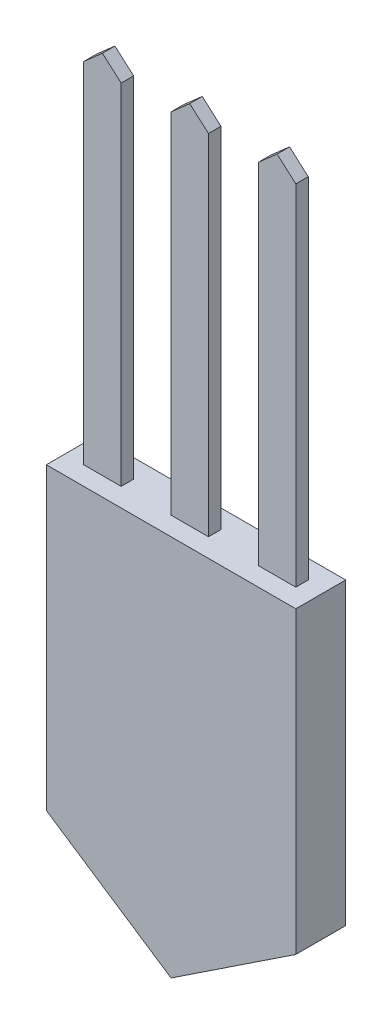
ISO-10303-21;
HEADER;
FILE_DESCRIPTION(('STEP AP214'),'2;1');
FILE_NAME('part.step','',(''),(''),'','','');
FILE_SCHEMA(('AUTOMOTIVE_DESIGN { 1 0 10303 214 1 1 1 1 }'));
ENDSEC;
DATA;
#1=APPLICATION_CONTEXT('core data for automotive mechanical design processes');
#2=APPLICATION_PROTOCOL_DEFINITION('international standard','automotive_design',2000,#1);
#3=PRODUCT_CONTEXT('',#1,'mechanical');
#4=PRODUCT('Part','Part','',(#3));
#5=PRODUCT_RELATED_PRODUCT_CATEGORY('part','',(#4));
#6=PRODUCT_DEFINITION_FORMATION('','',#4);
#7=PRODUCT_DEFINITION_CONTEXT('part definition',#1,'design');
#8=PRODUCT_DEFINITION('design','',#6,#7);
#9=PRODUCT_DEFINITION_SHAPE('','',#8);
#10=(LENGTH_UNIT() NAMED_UNIT(*) SI_UNIT(.MILLI.,.METRE.));
#11=(NAMED_UNIT(*) PLANE_ANGLE_UNIT() SI_UNIT($,.RADIAN.));
#12=(NAMED_UNIT(*) SI_UNIT($,.STERADIAN.) SOLID_ANGLE_UNIT());
#13=UNCERTAINTY_MEASURE_WITH_UNIT(LENGTH_MEASURE(1.E-05),#10,'distance_accuracy_value','');
#14=(GEOMETRIC_REPRESENTATION_CONTEXT(3) GLOBAL_UNCERTAINTY_ASSIGNED_CONTEXT((#13)) GLOBAL_UNIT_ASSIGNED_CONTEXT((#10,
#11,#12)) REPRESENTATION_CONTEXT('',''));
#15=CARTESIAN_POINT('',(0.,0.,0.));
#16=DIRECTION('',(0.,0.,1.));
#17=DIRECTION('',(1.,0.,0.));
#18=AXIS2_PLACEMENT_3D('',#15,#16,#17);
#19=CARTESIAN_POINT('',(0.,76.2,0.));
#20=DIRECTION('',(0.,-1.,0.));
#21=DIRECTION('',(0.,0.,-1.));
#22=AXIS2_PLACEMENT_3D('',#19,#20,#21);
#23=PLANE('',#22);
#24=DIRECTION('',(0.,0.,-1.));
#25=VECTOR('',#24,1.);
#26=CARTESIAN_POINT('',(-17.4625,76.2,1.5875));
#27=LINE('',#26,#25);
#28=CARTESIAN_POINT('',(-17.4625,76.2,1.5875));
#29=VERTEX_POINT('',#28);
#30=CARTESIAN_POINT('',(-17.4625,76.2,-1.5875));
#31=VERTEX_POINT('',#30);
#32=EDGE_CURVE('E265',#29,#31,#27,.T.);
#33=ORIENTED_EDGE('',*,*,#32,.F.);
#34=DIRECTION('',(1.,0.,0.));
#35=VECTOR('',#34,1.);
#36=CARTESIAN_POINT('',(-26.9875,76.2,1.5875));
#37=LINE('',#36,#35);
#38=CARTESIAN_POINT('',(-26.9875,76.2,1.5875));
#39=VERTEX_POINT('',#38);
#40=EDGE_CURVE('E255',#39,#29,#37,.T.);
#41=ORIENTED_EDGE('',*,*,#40,.F.);
#42=DIRECTION('',(0.,0.,1.));
#43=VECTOR('',#42,1.);
#44=CARTESIAN_POINT('',(-26.9875,76.2,1.5875));
#45=LINE('',#44,#43);
#46=CARTESIAN_POINT('',(-26.9875,76.2,-1.5875));
#47=VERTEX_POINT('',#46);
#48=EDGE_CURVE('E259',#47,#39,#45,.T.);
#49=ORIENTED_EDGE('',*,*,#48,.F.);
#50=DIRECTION('',(-1.,0.,0.));
#51=VECTOR('',#50,1.);
#52=CARTESIAN_POINT('',(-26.9875,76.2,-1.5875));
#53=LINE('',#52,#51);
#54=EDGE_CURVE('E262',#31,#47,#53,.T.);
#55=ORIENTED_EDGE('',*,*,#54,.F.);
#56=EDGE_LOOP('',(#33,#41,#49,#55));
#57=FACE_BOUND('',#56,.T.);
#58=DIRECTION('',(0.,0.,-1.));
#59=VECTOR('',#58,1.);
#60=CARTESIAN_POINT('',(31.75,76.2,6.35));
#61=LINE('',#60,#59);
#62=CARTESIAN_POINT('',(31.75,76.2,6.35));
#63=VERTEX_POINT('',#62);
#64=CARTESIAN_POINT('',(31.75,76.2,-6.35));
#65=VERTEX_POINT('',#64);
#66=EDGE_CURVE('E192',#63,#65,#61,.T.);
#67=ORIENTED_EDGE('',*,*,#66,.T.);
#68=DIRECTION('',(-1.,0.,0.));
#69=VECTOR('',#68,1.);
#70=CARTESIAN_POINT('',(-31.75,76.2,-6.35));
#71=LINE('',#70,#69);
#72=CARTESIAN_POINT('',(-31.75,76.2,-6.35));
#73=VERTEX_POINT('',#72);
#74=EDGE_CURVE('E209',#65,#73,#71,.T.);
#75=ORIENTED_EDGE('',*,*,#74,.T.);
#76=DIRECTION('',(0.,0.,1.));
#77=VECTOR('',#76,1.);
#78=CARTESIAN_POINT('',(-31.75,76.2,6.35));
#79=LINE('',#78,#77);
#80=CARTESIAN_POINT('',(-31.75,76.2,6.35));
#81=VERTEX_POINT('',#80);
#82=EDGE_CURVE('E207',#73,#81,#79,.T.);
#83=ORIENTED_EDGE('',*,*,#82,.T.);
#84=DIRECTION('',(1.,0.,0.));
#85=VECTOR('',#84,1.);
#86=CARTESIAN_POINT('',(-31.75,76.2,6.35));
#87=LINE('',#86,#85);
#88=EDGE_CURVE('E197',#81,#63,#87,.T.);
#89=ORIENTED_EDGE('',*,*,#88,.T.);
#90=EDGE_LOOP('',(#67,#75,#83,#89));
#91=FACE_BOUND('',#90,.T.);
#92=DIRECTION('',(0.,0.,-1.));
#93=VECTOR('',#92,1.);
#94=CARTESIAN_POINT('',(4.7625,76.2,1.5875));
#95=LINE('',#94,#93);
#96=CARTESIAN_POINT('',(4.7625,76.2,1.5875));
#97=VERTEX_POINT('',#96);
#98=CARTESIAN_POINT('',(4.7625,76.2,-1.5875));
#99=VERTEX_POINT('',#98);
#100=EDGE_CURVE('E235',#97,#99,#95,.T.);
#101=ORIENTED_EDGE('',*,*,#100,.F.);
#102=DIRECTION('',(1.,0.,0.));
#103=VECTOR('',#102,1.);
#104=CARTESIAN_POINT('',(-4.7625,76.2,1.5875));
#105=LINE('',#104,#103);
#106=CARTESIAN_POINT('',(-4.7625,76.2,1.5875));
#107=VERTEX_POINT('',#106);
#108=EDGE_CURVE('E225',#107,#97,#105,.T.);
#109=ORIENTED_EDGE('',*,*,#108,.F.);
#110=DIRECTION('',(0.,0.,1.));
#111=VECTOR('',#110,1.);
#112=CARTESIAN_POINT('',(-4.7625,76.2,1.5875));
#113=LINE('',#112,#111);
#114=CARTESIAN_POINT('',(-4.7625,76.2,-1.5875));
#115=VERTEX_POINT('',#114);
#116=EDGE_CURVE('E229',#115,#107,#113,.T.);
#117=ORIENTED_EDGE('',*,*,#116,.F.);
#118=DIRECTION('',(-1.,0.,0.));
#119=VECTOR('',#118,1.);
#120=CARTESIAN_POINT('',(-4.7625,76.2,-1.5875));
#121=LINE('',#120,#119);
#122=EDGE_CURVE('E232',#99,#115,#121,.T.);
#123=ORIENTED_EDGE('',*,*,#122,.F.);
#124=EDGE_LOOP('',(#101,#109,#117,#123));
#125=FACE_BOUND('',#124,.T.);
#126=DIRECTION('',(0.,0.,1.));
#127=VECTOR('',#126,1.);
#128=CARTESIAN_POINT('',(17.4625,76.2,1.5875));
#129=LINE('',#128,#127);
#130=CARTESIAN_POINT('',(17.4625,76.2,-1.5875));
#131=VERTEX_POINT('',#130);
#132=CARTESIAN_POINT('',(17.4625,76.2,1.5875));
#133=VERTEX_POINT('',#132);
#134=EDGE_CURVE('E290',#131,#133,#129,.T.);
#135=ORIENTED_EDGE('',*,*,#134,.F.);
#136=DIRECTION('',(-1.,0.,0.));
#137=VECTOR('',#136,1.);
#138=CARTESIAN_POINT('',(26.9875,76.2,-1.5875));
#139=LINE('',#138,#137);
#140=CARTESIAN_POINT('',(26.9875,76.2,-1.5875));
#141=VERTEX_POINT('',#140);
#142=EDGE_CURVE('E284',#141,#131,#139,.T.);
#143=ORIENTED_EDGE('',*,*,#142,.F.);
#144=DIRECTION('',(0.,0.,-1.));
#145=VECTOR('',#144,1.);
#146=CARTESIAN_POINT('',(26.9875,76.2,1.5875));
#147=LINE('',#146,#145);
#148=CARTESIAN_POINT('',(26.9875,76.2,1.5875));
#149=VERTEX_POINT('',#148);
#150=EDGE_CURVE('E56',#149,#141,#147,.T.);
#151=ORIENTED_EDGE('',*,*,#150,.F.);
#152=DIRECTION('',(1.,0.,0.));
#153=VECTOR('',#152,1.);
#154=CARTESIAN_POINT('',(26.9875,76.2,1.5875));
#155=LINE('',#154,#153);
#156=EDGE_CURVE('E51',#133,#149,#155,.T.);
#157=ORIENTED_EDGE('',*,*,#156,.F.);
#158=EDGE_LOOP('',(#135,#143,#151,#157));
#159=FACE_BOUND('',#158,.T.);
#160=ADVANCED_FACE('F36',(#57,#91,#125,#159),#23,.F.);
#161=CARTESIAN_POINT('',(31.75,76.2,6.35));
#162=DIRECTION('',(-1.,0.,0.));
#163=DIRECTION('',(0.,0.,1.));
#164=AXIS2_PLACEMENT_3D('',#161,#162,#163);
#165=PLANE('',#164);
#166=DIRECTION('',(0.,0.,-1.));
#167=VECTOR('',#166,1.);
#168=CARTESIAN_POINT('',(31.75,0.,6.35));
#169=LINE('',#168,#167);
#170=CARTESIAN_POINT('',(31.75,0.,6.35));
#171=VERTEX_POINT('',#170);
#172=CARTESIAN_POINT('',(31.75,0.,-6.34999999999999));
#173=VERTEX_POINT('',#172);
#174=EDGE_CURVE('E193',#171,#173,#169,.T.);
#175=ORIENTED_EDGE('',*,*,#174,.T.);
#176=DIRECTION('',(0.,-1.,0.));
#177=VECTOR('',#176,1.);
#178=CARTESIAN_POINT('',(31.75,76.2,-6.35));
#179=LINE('',#178,#177);
#180=EDGE_CURVE('E11',#65,#173,#179,.T.);
#181=ORIENTED_EDGE('',*,*,#180,.F.);
#182=ORIENTED_EDGE('',*,*,#66,.F.);
#183=DIRECTION('',(0.,-1.,0.));
#184=VECTOR('',#183,1.);
#185=CARTESIAN_POINT('',(31.75,76.2,6.35));
#186=LINE('',#185,#184);
#187=EDGE_CURVE('E198',#63,#171,#186,.T.);
#188=ORIENTED_EDGE('',*,*,#187,.T.);
#189=EDGE_LOOP('',(#175,#181,#182,#188));
#190=FACE_BOUND('',#189,.T.);
#191=ADVANCED_FACE('F38',(#190),#165,.F.);
#192=CARTESIAN_POINT('',(-31.75,76.2,-6.35));
#193=DIRECTION('',(0.,0.,1.));
#194=DIRECTION('',(1.,0.,0.));
#195=AXIS2_PLACEMENT_3D('',#192,#193,#194);
#196=PLANE('',#195);
#197=ORIENTED_EDGE('',*,*,#180,.T.);
#198=DIRECTION('',(-0.833333333333333,-0.552770798392567,0.));
#199=VECTOR('',#198,1.);
#200=CARTESIAN_POINT('',(31.75,0.,-6.34999999999999));
#201=LINE('',#200,#199);
#202=CARTESIAN_POINT('',(0.,-21.0605674187568,-6.34999999999999));
#203=VERTEX_POINT('',#202);
#204=EDGE_CURVE('E338',#173,#203,#201,.T.);
#205=ORIENTED_EDGE('',*,*,#204,.T.);
#206=DIRECTION('',(-0.833333333333333,0.552770798392567,0.));
#207=VECTOR('',#206,1.);
#208=CARTESIAN_POINT('',(0.,-21.0605674187568,-6.34999999999999));
#209=LINE('',#208,#207);
#210=CARTESIAN_POINT('',(-31.75,0.,-6.35));
#211=VERTEX_POINT('',#210);
#212=EDGE_CURVE('E333',#203,#211,#209,.T.);
#213=ORIENTED_EDGE('',*,*,#212,.T.);
#214=DIRECTION('',(0.,-1.,0.));
#215=VECTOR('',#214,1.);
#216=CARTESIAN_POINT('',(-31.75,76.2,-6.35));
#217=LINE('',#216,#215);
#218=EDGE_CURVE('E44',#73,#211,#217,.T.);
#219=ORIENTED_EDGE('',*,*,#218,.F.);
#220=ORIENTED_EDGE('',*,*,#74,.F.);
#221=EDGE_LOOP('',(#197,#205,#213,#219,#220));
#222=FACE_BOUND('',#221,.T.);
#223=ADVANCED_FACE('F342',(#222),#196,.F.);
#224=CARTESIAN_POINT('',(-31.75,76.2,6.35));
#225=DIRECTION('',(1.,0.,0.));
#226=DIRECTION('',(0.,0.,-1.));
#227=AXIS2_PLACEMENT_3D('',#224,#225,#226);
#228=PLANE('',#227);
#229=DIRECTION('',(0.,0.,1.));
#230=VECTOR('',#229,1.);
#231=CARTESIAN_POINT('',(-31.75,0.,6.35));
#232=LINE('',#231,#230);
#233=CARTESIAN_POINT('',(-31.75,0.,6.35));
#234=VERTEX_POINT('',#233);
#235=EDGE_CURVE('E174',#211,#234,#232,.T.);
#236=ORIENTED_EDGE('',*,*,#235,.T.);
#237=DIRECTION('',(0.,-1.,0.));
#238=VECTOR('',#237,1.);
#239=CARTESIAN_POINT('',(-31.75,76.2,6.35));
#240=LINE('',#239,#238);
#241=EDGE_CURVE('E189',#81,#234,#240,.T.);
#242=ORIENTED_EDGE('',*,*,#241,.F.);
#243=ORIENTED_EDGE('',*,*,#82,.F.);
#244=ORIENTED_EDGE('',*,*,#218,.T.);
#245=EDGE_LOOP('',(#236,#242,#243,#244));
#246=FACE_BOUND('',#245,.T.);
#247=ADVANCED_FACE('F187',(#246),#228,.F.);
#248=CARTESIAN_POINT('',(-31.75,76.2,6.35));
#249=DIRECTION('',(0.,0.,-1.));
#250=DIRECTION('',(-1.,0.,0.));
#251=AXIS2_PLACEMENT_3D('',#248,#249,#250);
#252=PLANE('',#251);
#253=ORIENTED_EDGE('',*,*,#241,.T.);
#254=DIRECTION('',(0.833333333333333,-0.552770798392567,0.));
#255=VECTOR('',#254,1.);
#256=CARTESIAN_POINT('',(0.,-21.0605674187568,6.35));
#257=LINE('',#256,#255);
#258=CARTESIAN_POINT('',(0.,-21.0605674187568,6.35));
#259=VERTEX_POINT('',#258);
#260=EDGE_CURVE('E170',#234,#259,#257,.T.);
#261=ORIENTED_EDGE('',*,*,#260,.T.);
#262=DIRECTION('',(0.833333333333333,0.552770798392567,0.));
#263=VECTOR('',#262,1.);
#264=CARTESIAN_POINT('',(31.75,0.,6.35));
#265=LINE('',#264,#263);
#266=EDGE_CURVE('E182',#259,#171,#265,.T.);
#267=ORIENTED_EDGE('',*,*,#266,.T.);
#268=ORIENTED_EDGE('',*,*,#187,.F.);
#269=ORIENTED_EDGE('',*,*,#88,.F.);
#270=EDGE_LOOP('',(#253,#261,#267,#268,#269));
#271=FACE_BOUND('',#270,.T.);
#272=ADVANCED_FACE('F195',(#271),#252,.F.);
#273=CARTESIAN_POINT('',(4.7625,165.1,1.5875));
#274=DIRECTION('',(-1.,0.,0.));
#275=DIRECTION('',(0.,0.,1.));
#276=AXIS2_PLACEMENT_3D('',#273,#274,#275);
#277=PLANE('',#276);
#278=ORIENTED_EDGE('',*,*,#100,.T.);
#279=DIRECTION('',(0.,-1.,0.));
#280=VECTOR('',#279,1.);
#281=CARTESIAN_POINT('',(4.7625,165.1,-1.5875));
#282=LINE('',#281,#280);
#283=CARTESIAN_POINT('',(4.7625,165.1,-1.5875));
#284=VERTEX_POINT('',#283);
#285=EDGE_CURVE('E205',#284,#99,#282,.T.);
#286=ORIENTED_EDGE('',*,*,#285,.F.);
#287=DIRECTION('',(0.,0.,-1.));
#288=VECTOR('',#287,1.);
#289=CARTESIAN_POINT('',(4.7625,165.1,1.5875));
#290=LINE('',#289,#288);
#291=CARTESIAN_POINT('',(4.7625,165.1,1.5875));
#292=VERTEX_POINT('',#291);
#293=EDGE_CURVE('E228',#292,#284,#290,.T.);
#294=ORIENTED_EDGE('',*,*,#293,.F.);
#295=DIRECTION('',(0.,-1.,0.));
#296=VECTOR('',#295,1.);
#297=CARTESIAN_POINT('',(4.7625,165.1,1.5875));
#298=LINE('',#297,#296);
#299=EDGE_CURVE('E221',#292,#97,#298,.T.);
#300=ORIENTED_EDGE('',*,*,#299,.T.);
#301=EDGE_LOOP('',(#278,#286,#294,#300));
#302=FACE_BOUND('',#301,.T.);
#303=ADVANCED_FACE('F409',(#302),#277,.F.);
#304=CARTESIAN_POINT('',(-4.7625,165.1,-1.5875));
#305=DIRECTION('',(0.,0.,1.));
#306=DIRECTION('',(1.,0.,0.));
#307=AXIS2_PLACEMENT_3D('',#304,#305,#306);
#308=PLANE('',#307);
#309=ORIENTED_EDGE('',*,*,#122,.T.);
#310=DIRECTION('',(0.,-1.,0.));
#311=VECTOR('',#310,1.);
#312=CARTESIAN_POINT('',(-4.7625,165.1,-1.5875));
#313=LINE('',#312,#311);
#314=CARTESIAN_POINT('',(-4.7625,165.1,-1.5875));
#315=VERTEX_POINT('',#314);
#316=EDGE_CURVE('E215',#315,#115,#313,.T.);
#317=ORIENTED_EDGE('',*,*,#316,.F.);
#318=DIRECTION('',(0.75,0.661437827766148,0.));
#319=VECTOR('',#318,1.);
#320=CARTESIAN_POINT('',(-4.7625,165.1,-1.5875));
#321=LINE('',#320,#319);
#322=CARTESIAN_POINT('',(0.,169.300130206315,-1.5875));
#323=VERTEX_POINT('',#322);
#324=EDGE_CURVE('E314',#315,#323,#321,.T.);
#325=ORIENTED_EDGE('',*,*,#324,.T.);
#326=DIRECTION('',(0.75,-0.661437827766148,0.));
#327=VECTOR('',#326,1.);
#328=CARTESIAN_POINT('',(0.,169.300130206315,-1.5875));
#329=LINE('',#328,#327);
#330=EDGE_CURVE('E317',#323,#284,#329,.T.);
#331=ORIENTED_EDGE('',*,*,#330,.T.);
#332=ORIENTED_EDGE('',*,*,#285,.T.);
#333=EDGE_LOOP('',(#309,#317,#325,#331,#332));
#334=FACE_BOUND('',#333,.T.);
#335=ADVANCED_FACE('F405',(#334),#308,.F.);
#336=CARTESIAN_POINT('',(-4.7625,165.1,1.5875));
#337=DIRECTION('',(1.,0.,0.));
#338=DIRECTION('',(0.,0.,-1.));
#339=AXIS2_PLACEMENT_3D('',#336,#337,#338);
#340=PLANE('',#339);
#341=ORIENTED_EDGE('',*,*,#116,.T.);
#342=DIRECTION('',(0.,-1.,0.));
#343=VECTOR('',#342,1.);
#344=CARTESIAN_POINT('',(-4.7625,165.1,1.5875));
#345=LINE('',#344,#343);
#346=CARTESIAN_POINT('',(-4.7625,165.1,1.5875));
#347=VERTEX_POINT('',#346);
#348=EDGE_CURVE('E218',#347,#107,#345,.T.);
#349=ORIENTED_EDGE('',*,*,#348,.F.);
#350=DIRECTION('',(0.,0.,1.));
#351=VECTOR('',#350,1.);
#352=CARTESIAN_POINT('',(-4.7625,165.1,1.5875));
#353=LINE('',#352,#351);
#354=EDGE_CURVE('E224',#315,#347,#353,.T.);
#355=ORIENTED_EDGE('',*,*,#354,.F.);
#356=ORIENTED_EDGE('',*,*,#316,.T.);
#357=EDGE_LOOP('',(#341,#349,#355,#356));
#358=FACE_BOUND('',#357,.T.);
#359=ADVANCED_FACE('F401',(#358),#340,.F.);
#360=CARTESIAN_POINT('',(-4.7625,165.1,1.5875));
#361=DIRECTION('',(0.,0.,-1.));
#362=DIRECTION('',(-1.,0.,0.));
#363=AXIS2_PLACEMENT_3D('',#360,#361,#362);
#364=PLANE('',#363);
#365=ORIENTED_EDGE('',*,*,#108,.T.);
#366=ORIENTED_EDGE('',*,*,#299,.F.);
#367=DIRECTION('',(-0.749999999999999,0.661437827766148,0.));
#368=VECTOR('',#367,1.);
#369=CARTESIAN_POINT('',(0.,169.300130206315,1.5875));
#370=LINE('',#369,#368);
#371=CARTESIAN_POINT('',(0.,169.300130206315,1.5875));
#372=VERTEX_POINT('',#371);
#373=EDGE_CURVE('E307',#292,#372,#370,.T.);
#374=ORIENTED_EDGE('',*,*,#373,.T.);
#375=DIRECTION('',(-0.749999999999999,-0.661437827766148,0.));
#376=VECTOR('',#375,1.);
#377=CARTESIAN_POINT('',(-4.7625,165.1,1.5875));
#378=LINE('',#377,#376);
#379=EDGE_CURVE('E313',#372,#347,#378,.T.);
#380=ORIENTED_EDGE('',*,*,#379,.T.);
#381=ORIENTED_EDGE('',*,*,#348,.T.);
#382=EDGE_LOOP('',(#365,#366,#374,#380,#381));
#383=FACE_BOUND('',#382,.T.);
#384=ADVANCED_FACE('F397',(#383),#364,.F.);
#385=CARTESIAN_POINT('',(-17.4625,165.1,1.5875));
#386=DIRECTION('',(-1.,0.,0.));
#387=DIRECTION('',(0.,0.,1.));
#388=AXIS2_PLACEMENT_3D('',#385,#386,#387);
#389=PLANE('',#388);
#390=ORIENTED_EDGE('',*,*,#32,.T.);
#391=DIRECTION('',(0.,-1.,0.));
#392=VECTOR('',#391,1.);
#393=CARTESIAN_POINT('',(-17.4625,165.1,-1.5875));
#394=LINE('',#393,#392);
#395=CARTESIAN_POINT('',(-17.4625,165.1,-1.5875));
#396=VERTEX_POINT('',#395);
#397=EDGE_CURVE('E238',#396,#31,#394,.T.);
#398=ORIENTED_EDGE('',*,*,#397,.F.);
#399=DIRECTION('',(0.,0.,-1.));
#400=VECTOR('',#399,1.);
#401=CARTESIAN_POINT('',(-17.4625,165.1,1.5875));
#402=LINE('',#401,#400);
#403=CARTESIAN_POINT('',(-17.4625,165.1,1.5875));
#404=VERTEX_POINT('',#403);
#405=EDGE_CURVE('E258',#404,#396,#402,.T.);
#406=ORIENTED_EDGE('',*,*,#405,.F.);
#407=DIRECTION('',(0.,-1.,0.));
#408=VECTOR('',#407,1.);
#409=CARTESIAN_POINT('',(-17.4625,165.1,1.5875));
#410=LINE('',#409,#408);
#411=EDGE_CURVE('E251',#404,#29,#410,.T.);
#412=ORIENTED_EDGE('',*,*,#411,.T.);
#413=EDGE_LOOP('',(#390,#398,#406,#412));
#414=FACE_BOUND('',#413,.T.);
#415=ADVANCED_FACE('F393',(#414),#389,.F.);
#416=CARTESIAN_POINT('',(-26.9875,165.1,-1.5875));
#417=DIRECTION('',(0.,0.,1.));
#418=DIRECTION('',(1.,0.,0.));
#419=AXIS2_PLACEMENT_3D('',#416,#417,#418);
#420=PLANE('',#419);
#421=ORIENTED_EDGE('',*,*,#54,.T.);
#422=DIRECTION('',(0.,-1.,0.));
#423=VECTOR('',#422,1.);
#424=CARTESIAN_POINT('',(-26.9875,165.1,-1.5875));
#425=LINE('',#424,#423);
#426=CARTESIAN_POINT('',(-26.9875,165.1,-1.5875));
#427=VERTEX_POINT('',#426);
#428=EDGE_CURVE('E245',#427,#47,#425,.T.);
#429=ORIENTED_EDGE('',*,*,#428,.F.);
#430=DIRECTION('',(0.749999999999999,0.661437827766148,0.));
#431=VECTOR('',#430,1.);
#432=CARTESIAN_POINT('',(-26.9875,165.1,-1.5875));
#433=LINE('',#432,#431);
#434=CARTESIAN_POINT('',(-22.225,169.300130206315,-1.5875));
#435=VERTEX_POINT('',#434);
#436=EDGE_CURVE('E327',#427,#435,#433,.T.);
#437=ORIENTED_EDGE('',*,*,#436,.T.);
#438=DIRECTION('',(0.749999999999999,-0.661437827766148,0.));
#439=VECTOR('',#438,1.);
#440=CARTESIAN_POINT('',(-22.225,169.300130206315,-1.5875));
#441=LINE('',#440,#439);
#442=EDGE_CURVE('E330',#435,#396,#441,.T.);
#443=ORIENTED_EDGE('',*,*,#442,.T.);
#444=ORIENTED_EDGE('',*,*,#397,.T.);
#445=EDGE_LOOP('',(#421,#429,#437,#443,#444));
#446=FACE_BOUND('',#445,.T.);
#447=ADVANCED_FACE('F389',(#446),#420,.F.);
#448=CARTESIAN_POINT('',(-26.9875,165.1,1.5875));
#449=DIRECTION('',(1.,0.,0.));
#450=DIRECTION('',(0.,0.,-1.));
#451=AXIS2_PLACEMENT_3D('',#448,#449,#450);
#452=PLANE('',#451);
#453=ORIENTED_EDGE('',*,*,#48,.T.);
#454=DIRECTION('',(0.,-1.,0.));
#455=VECTOR('',#454,1.);
#456=CARTESIAN_POINT('',(-26.9875,165.1,1.5875));
#457=LINE('',#456,#455);
#458=CARTESIAN_POINT('',(-26.9875,165.1,1.5875));
#459=VERTEX_POINT('',#458);
#460=EDGE_CURVE('E248',#459,#39,#457,.T.);
#461=ORIENTED_EDGE('',*,*,#460,.F.);
#462=DIRECTION('',(0.,0.,1.));
#463=VECTOR('',#462,1.);
#464=CARTESIAN_POINT('',(-26.9875,165.1,1.5875));
#465=LINE('',#464,#463);
#466=EDGE_CURVE('E254',#427,#459,#465,.T.);
#467=ORIENTED_EDGE('',*,*,#466,.F.);
#468=ORIENTED_EDGE('',*,*,#428,.T.);
#469=EDGE_LOOP('',(#453,#461,#467,#468));
#470=FACE_BOUND('',#469,.T.);
#471=ADVANCED_FACE('F385',(#470),#452,.F.);
#472=CARTESIAN_POINT('',(-26.9875,165.1,1.5875));
#473=DIRECTION('',(0.,0.,-1.));
#474=DIRECTION('',(-1.,0.,0.));
#475=AXIS2_PLACEMENT_3D('',#472,#473,#474);
#476=PLANE('',#475);
#477=ORIENTED_EDGE('',*,*,#40,.T.);
#478=ORIENTED_EDGE('',*,*,#411,.F.);
#479=DIRECTION('',(-0.749999999999999,0.661437827766148,0.));
#480=VECTOR('',#479,1.);
#481=CARTESIAN_POINT('',(-22.225,169.300130206315,1.5875));
#482=LINE('',#481,#480);
#483=CARTESIAN_POINT('',(-22.225,169.300130206315,1.5875));
#484=VERTEX_POINT('',#483);
#485=EDGE_CURVE('E320',#404,#484,#482,.T.);
#486=ORIENTED_EDGE('',*,*,#485,.T.);
#487=DIRECTION('',(-0.749999999999999,-0.661437827766148,0.));
#488=VECTOR('',#487,1.);
#489=CARTESIAN_POINT('',(-26.9875,165.1,1.5875));
#490=LINE('',#489,#488);
#491=EDGE_CURVE('E326',#484,#459,#490,.T.);
#492=ORIENTED_EDGE('',*,*,#491,.T.);
#493=ORIENTED_EDGE('',*,*,#460,.T.);
#494=EDGE_LOOP('',(#477,#478,#486,#492,#493));
#495=FACE_BOUND('',#494,.T.);
#496=ADVANCED_FACE('F379',(#495),#476,.F.);
#497=CARTESIAN_POINT('',(17.4625,165.1,1.5875));
#498=DIRECTION('',(1.,0.,0.));
#499=DIRECTION('',(0.,0.,-1.));
#500=AXIS2_PLACEMENT_3D('',#497,#498,#499);
#501=PLANE('',#500);
#502=ORIENTED_EDGE('',*,*,#134,.T.);
#503=DIRECTION('',(0.,-1.,0.));
#504=VECTOR('',#503,1.);
#505=CARTESIAN_POINT('',(17.4625,165.1,1.5875));
#506=LINE('',#505,#504);
#507=CARTESIAN_POINT('',(17.4625,165.1,1.5875));
#508=VERTEX_POINT('',#507);
#509=EDGE_CURVE('E268',#508,#133,#506,.T.);
#510=ORIENTED_EDGE('',*,*,#509,.F.);
#511=DIRECTION('',(0.,0.,1.));
#512=VECTOR('',#511,1.);
#513=CARTESIAN_POINT('',(17.4625,165.1,1.5875));
#514=LINE('',#513,#512);
#515=CARTESIAN_POINT('',(17.4625,165.1,-1.5875));
#516=VERTEX_POINT('',#515);
#517=EDGE_CURVE('E287',#516,#508,#514,.T.);
#518=ORIENTED_EDGE('',*,*,#517,.F.);
#519=DIRECTION('',(0.,-1.,0.));
#520=VECTOR('',#519,1.);
#521=CARTESIAN_POINT('',(17.4625,165.1,-1.5875));
#522=LINE('',#521,#520);
#523=EDGE_CURVE('E280',#516,#131,#522,.T.);
#524=ORIENTED_EDGE('',*,*,#523,.T.);
#525=EDGE_LOOP('',(#502,#510,#518,#524));
#526=FACE_BOUND('',#525,.T.);
#527=ADVANCED_FACE('F358',(#526),#501,.F.);
#528=CARTESIAN_POINT('',(26.9875,165.1,1.5875));
#529=DIRECTION('',(0.,0.,-1.));
#530=DIRECTION('',(-1.,0.,0.));
#531=AXIS2_PLACEMENT_3D('',#528,#529,#530);
#532=PLANE('',#531);
#533=ORIENTED_EDGE('',*,*,#156,.T.);
#534=DIRECTION('',(0.,-1.,0.));
#535=VECTOR('',#534,1.);
#536=CARTESIAN_POINT('',(26.9875,165.1,1.5875));
#537=LINE('',#536,#535);
#538=CARTESIAN_POINT('',(26.9875,165.1,1.5875));
#539=VERTEX_POINT('',#538);
#540=EDGE_CURVE('E274',#539,#149,#537,.T.);
#541=ORIENTED_EDGE('',*,*,#540,.F.);
#542=DIRECTION('',(-0.749999999999999,0.661437827766148,0.));
#543=VECTOR('',#542,1.);
#544=CARTESIAN_POINT('',(22.225,169.300130206315,1.5875));
#545=LINE('',#544,#543);
#546=CARTESIAN_POINT('',(22.225,169.300130206315,1.5875));
#547=VERTEX_POINT('',#546);
#548=EDGE_CURVE('E293',#539,#547,#545,.T.);
#549=ORIENTED_EDGE('',*,*,#548,.T.);
#550=DIRECTION('',(-0.749999999999999,-0.661437827766148,0.));
#551=VECTOR('',#550,1.);
#552=CARTESIAN_POINT('',(17.4625,165.1,1.5875));
#553=LINE('',#552,#551);
#554=EDGE_CURVE('E300',#547,#508,#553,.T.);
#555=ORIENTED_EDGE('',*,*,#554,.T.);
#556=ORIENTED_EDGE('',*,*,#509,.T.);
#557=EDGE_LOOP('',(#533,#541,#549,#555,#556));
#558=FACE_BOUND('',#557,.T.);
#559=ADVANCED_FACE('F371',(#558),#532,.F.);
#560=CARTESIAN_POINT('',(26.9875,165.1,1.5875));
#561=DIRECTION('',(-1.,0.,0.));
#562=DIRECTION('',(0.,0.,1.));
#563=AXIS2_PLACEMENT_3D('',#560,#561,#562);
#564=PLANE('',#563);
#565=ORIENTED_EDGE('',*,*,#150,.T.);
#566=DIRECTION('',(0.,-1.,0.));
#567=VECTOR('',#566,1.);
#568=CARTESIAN_POINT('',(26.9875,165.1,-1.5875));
#569=LINE('',#568,#567);
#570=CARTESIAN_POINT('',(26.9875,165.1,-1.5875));
#571=VERTEX_POINT('',#570);
#572=EDGE_CURVE('E277',#571,#141,#569,.T.);
#573=ORIENTED_EDGE('',*,*,#572,.F.);
#574=DIRECTION('',(0.,0.,-1.));
#575=VECTOR('',#574,1.);
#576=CARTESIAN_POINT('',(26.9875,165.1,1.5875));
#577=LINE('',#576,#575);
#578=EDGE_CURVE('E283',#539,#571,#577,.T.);
#579=ORIENTED_EDGE('',*,*,#578,.F.);
#580=ORIENTED_EDGE('',*,*,#540,.T.);
#581=EDGE_LOOP('',(#565,#573,#579,#580));
#582=FACE_BOUND('',#581,.T.);
#583=ADVANCED_FACE('F369',(#582),#564,.F.);
#584=CARTESIAN_POINT('',(26.9875,165.1,-1.5875));
#585=DIRECTION('',(0.,0.,1.));
#586=DIRECTION('',(1.,0.,0.));
#587=AXIS2_PLACEMENT_3D('',#584,#585,#586);
#588=PLANE('',#587);
#589=ORIENTED_EDGE('',*,*,#142,.T.);
#590=ORIENTED_EDGE('',*,*,#523,.F.);
#591=DIRECTION('',(0.749999999999999,0.661437827766148,0.));
#592=VECTOR('',#591,1.);
#593=CARTESIAN_POINT('',(17.4625,165.1,-1.5875));
#594=LINE('',#593,#592);
#595=CARTESIAN_POINT('',(22.225,169.300130206315,-1.5875));
#596=VERTEX_POINT('',#595);
#597=EDGE_CURVE('E301',#516,#596,#594,.T.);
#598=ORIENTED_EDGE('',*,*,#597,.T.);
#599=DIRECTION('',(0.749999999999999,-0.661437827766148,0.));
#600=VECTOR('',#599,1.);
#601=CARTESIAN_POINT('',(22.225,169.300130206315,-1.5875));
#602=LINE('',#601,#600);
#603=EDGE_CURVE('E304',#596,#571,#602,.T.);
#604=ORIENTED_EDGE('',*,*,#603,.T.);
#605=ORIENTED_EDGE('',*,*,#572,.T.);
#606=EDGE_LOOP('',(#589,#590,#598,#604,#605));
#607=FACE_BOUND('',#606,.T.);
#608=ADVANCED_FACE('F356',(#607),#588,.F.);
#609=CARTESIAN_POINT('',(22.225,169.300130206315,11.9974336573294));
#610=DIRECTION('',(0.661437827766148,0.749999999999999,0.));
#611=DIRECTION('',(-0.749999999999999,0.661437827766148,0.));
#612=AXIS2_PLACEMENT_3D('',#609,#610,#611);
#613=PLANE('',#612);
#614=ORIENTED_EDGE('',*,*,#548,.F.);
#615=ORIENTED_EDGE('',*,*,#578,.T.);
#616=ORIENTED_EDGE('',*,*,#603,.F.);
#617=DIRECTION('',(0.,0.,-1.));
#618=VECTOR('',#617,1.);
#619=CARTESIAN_POINT('',(22.225,169.300130206315,11.9974336573294));
#620=LINE('',#619,#618);
#621=EDGE_CURVE('E298',#547,#596,#620,.T.);
#622=ORIENTED_EDGE('',*,*,#621,.F.);
#623=EDGE_LOOP('',(#614,#615,#616,#622));
#624=FACE_BOUND('',#623,.T.);
#625=ADVANCED_FACE('F366',(#624),#613,.T.);
#626=CARTESIAN_POINT('',(17.4625,165.1,11.9974336573294));
#627=DIRECTION('',(-0.661437827766148,0.749999999999999,0.));
#628=DIRECTION('',(-0.749999999999999,-0.661437827766148,0.));
#629=AXIS2_PLACEMENT_3D('',#626,#627,#628);
#630=PLANE('',#629);
#631=ORIENTED_EDGE('',*,*,#554,.F.);
#632=ORIENTED_EDGE('',*,*,#621,.T.);
#633=ORIENTED_EDGE('',*,*,#597,.F.);
#634=ORIENTED_EDGE('',*,*,#517,.T.);
#635=EDGE_LOOP('',(#631,#632,#633,#634));
#636=FACE_BOUND('',#635,.T.);
#637=ADVANCED_FACE('F361',(#636),#630,.T.);
#638=CARTESIAN_POINT('',(0.,169.300130206315,11.9974336573294));
#639=DIRECTION('',(0.661437827766148,0.749999999999999,0.));
#640=DIRECTION('',(-0.749999999999999,0.661437827766148,0.));
#641=AXIS2_PLACEMENT_3D('',#638,#639,#640);
#642=PLANE('',#641);
#643=ORIENTED_EDGE('',*,*,#373,.F.);
#644=ORIENTED_EDGE('',*,*,#293,.T.);
#645=ORIENTED_EDGE('',*,*,#330,.F.);
#646=DIRECTION('',(0.,0.,-1.));
#647=VECTOR('',#646,1.);
#648=CARTESIAN_POINT('',(0.,169.300130206315,11.9974336573294));
#649=LINE('',#648,#647);
#650=EDGE_CURVE('E311',#372,#323,#649,.T.);
#651=ORIENTED_EDGE('',*,*,#650,.F.);
#652=EDGE_LOOP('',(#643,#644,#645,#651));
#653=FACE_BOUND('',#652,.T.);
#654=ADVANCED_FACE('F523',(#653),#642,.T.);
#655=CARTESIAN_POINT('',(-4.7625,165.1,11.9974336573294));
#656=DIRECTION('',(-0.661437827766148,0.749999999999999,0.));
#657=DIRECTION('',(-0.749999999999999,-0.661437827766148,0.));
#658=AXIS2_PLACEMENT_3D('',#655,#656,#657);
#659=PLANE('',#658);
#660=ORIENTED_EDGE('',*,*,#379,.F.);
#661=ORIENTED_EDGE('',*,*,#650,.T.);
#662=ORIENTED_EDGE('',*,*,#324,.F.);
#663=ORIENTED_EDGE('',*,*,#354,.T.);
#664=EDGE_LOOP('',(#660,#661,#662,#663));
#665=FACE_BOUND('',#664,.T.);
#666=ADVANCED_FACE('F532',(#665),#659,.T.);
#667=CARTESIAN_POINT('',(-22.225,169.300130206315,11.9974336573294));
#668=DIRECTION('',(0.661437827766148,0.749999999999999,0.));
#669=DIRECTION('',(-0.749999999999999,0.661437827766148,0.));
#670=AXIS2_PLACEMENT_3D('',#667,#668,#669);
#671=PLANE('',#670);
#672=ORIENTED_EDGE('',*,*,#485,.F.);
#673=ORIENTED_EDGE('',*,*,#405,.T.);
#674=ORIENTED_EDGE('',*,*,#442,.F.);
#675=DIRECTION('',(0.,0.,-1.));
#676=VECTOR('',#675,1.);
#677=CARTESIAN_POINT('',(-22.225,169.300130206315,11.9974336573294));
#678=LINE('',#677,#676);
#679=EDGE_CURVE('E324',#484,#435,#678,.T.);
#680=ORIENTED_EDGE('',*,*,#679,.F.);
#681=EDGE_LOOP('',(#672,#673,#674,#680));
#682=FACE_BOUND('',#681,.T.);
#683=ADVANCED_FACE('F542',(#682),#671,.T.);
#684=CARTESIAN_POINT('',(-26.9875,165.1,11.9974336573294));
#685=DIRECTION('',(-0.661437827766148,0.749999999999999,0.));
#686=DIRECTION('',(-0.749999999999999,-0.661437827766148,0.));
#687=AXIS2_PLACEMENT_3D('',#684,#685,#686);
#688=PLANE('',#687);
#689=ORIENTED_EDGE('',*,*,#491,.F.);
#690=ORIENTED_EDGE('',*,*,#679,.T.);
#691=ORIENTED_EDGE('',*,*,#436,.F.);
#692=ORIENTED_EDGE('',*,*,#466,.T.);
#693=EDGE_LOOP('',(#689,#690,#691,#692));
#694=FACE_BOUND('',#693,.T.);
#695=ADVANCED_FACE('F551',(#694),#688,.T.);
#696=CARTESIAN_POINT('',(31.75,0.,-73.2514013306149));
#697=DIRECTION('',(0.552770798392567,-0.833333333333333,0.));
#698=DIRECTION('',(0.833333333333333,0.552770798392567,0.));
#699=AXIS2_PLACEMENT_3D('',#696,#697,#698);
#700=PLANE('',#699);
#701=ORIENTED_EDGE('',*,*,#204,.F.);
#702=ORIENTED_EDGE('',*,*,#174,.F.);
#703=ORIENTED_EDGE('',*,*,#266,.F.);
#704=DIRECTION('',(0.,0.,1.));
#705=VECTOR('',#704,1.);
#706=CARTESIAN_POINT('',(0.,-21.0605674187568,-73.2514013306149));
#707=LINE('',#706,#705);
#708=EDGE_CURVE('E177',#203,#259,#707,.T.);
#709=ORIENTED_EDGE('',*,*,#708,.F.);
#710=EDGE_LOOP('',(#701,#702,#703,#709));
#711=FACE_BOUND('',#710,.T.);
#712=ADVANCED_FACE('F345',(#711),#700,.T.);
#713=CARTESIAN_POINT('',(0.,-21.0605674187568,-73.2514013306149));
#714=DIRECTION('',(-0.552770798392567,-0.833333333333333,0.));
#715=DIRECTION('',(0.833333333333333,-0.552770798392567,0.));
#716=AXIS2_PLACEMENT_3D('',#713,#714,#715);
#717=PLANE('',#716);
#718=ORIENTED_EDGE('',*,*,#212,.F.);
#719=ORIENTED_EDGE('',*,*,#708,.T.);
#720=ORIENTED_EDGE('',*,*,#260,.F.);
#721=ORIENTED_EDGE('',*,*,#235,.F.);
#722=EDGE_LOOP('',(#718,#719,#720,#721));
#723=FACE_BOUND('',#722,.T.);
#724=ADVANCED_FACE('F173',(#723),#717,.T.);
#725=CLOSED_SHELL('',(#160,#191,#223,#247,#272,#303,#335,#359,#384,#415,#447,#471,#496,#527,
#559,#583,#608,#625,#637,#654,#666,#683,#695,#712,#724));
#726=MANIFOLD_SOLID_BREP('B2',#725);
#727=ADVANCED_BREP_SHAPE_REPRESENTATION('',(#18,#726),#14);
#728=SHAPE_DEFINITION_REPRESENTATION(#9,#727);
ENDSEC;
END-ISO-10303-21;
